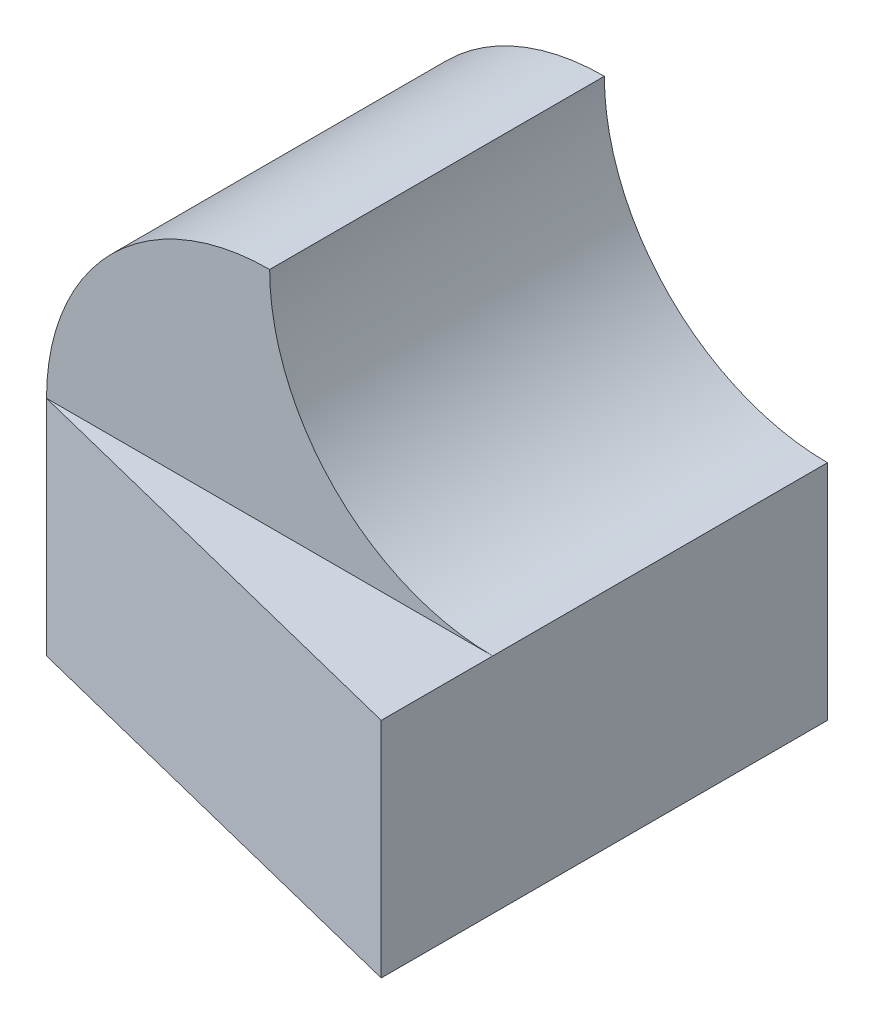
ISO-10303-21;
HEADER;
FILE_DESCRIPTION(('STEP AP214'),'2;1');
FILE_NAME('part.step','',(''),(''),'','','');
FILE_SCHEMA(('AUTOMOTIVE_DESIGN { 1 0 10303 214 1 1 1 1 }'));
ENDSEC;
DATA;
#1=APPLICATION_CONTEXT('core data for automotive mechanical design processes');
#2=APPLICATION_PROTOCOL_DEFINITION('international standard','automotive_design',2000,#1);
#3=PRODUCT_CONTEXT('',#1,'mechanical');
#4=PRODUCT('Part','Part','',(#3));
#5=PRODUCT_RELATED_PRODUCT_CATEGORY('part','',(#4));
#6=PRODUCT_DEFINITION_FORMATION('','',#4);
#7=PRODUCT_DEFINITION_CONTEXT('part definition',#1,'design');
#8=PRODUCT_DEFINITION('design','',#6,#7);
#9=PRODUCT_DEFINITION_SHAPE('','',#8);
#10=(LENGTH_UNIT() NAMED_UNIT(*) SI_UNIT(.MILLI.,.METRE.));
#11=(NAMED_UNIT(*) PLANE_ANGLE_UNIT() SI_UNIT($,.RADIAN.));
#12=(NAMED_UNIT(*) SI_UNIT($,.STERADIAN.) SOLID_ANGLE_UNIT());
#13=UNCERTAINTY_MEASURE_WITH_UNIT(LENGTH_MEASURE(1.E-05),#10,'distance_accuracy_value','');
#14=(GEOMETRIC_REPRESENTATION_CONTEXT(3) GLOBAL_UNCERTAINTY_ASSIGNED_CONTEXT((#13)) GLOBAL_UNIT_ASSIGNED_CONTEXT((#10,
#11,#12)) REPRESENTATION_CONTEXT('',''));
#15=CARTESIAN_POINT('',(0.,0.,0.));
#16=DIRECTION('',(0.,0.,1.));
#17=DIRECTION('',(1.,0.,0.));
#18=AXIS2_PLACEMENT_3D('',#15,#16,#17);
#19=CARTESIAN_POINT('',(0.,2.,3.));
#20=DIRECTION('',(1.,0.,0.));
#21=DIRECTION('',(0.,1.,0.));
#22=AXIS2_PLACEMENT_3D('',#19,#20,#21);
#23=PLANE('',#22);
#24=DIRECTION('',(0.,1.,0.));
#25=VECTOR('',#24,1.);
#26=CARTESIAN_POINT('',(0.,2.,1.));
#27=LINE('',#26,#25);
#28=CARTESIAN_POINT('',(0.,0.,1.));
#29=VERTEX_POINT('',#28);
#30=CARTESIAN_POINT('',(0.,2.,1.));
#31=VERTEX_POINT('',#30);
#32=EDGE_CURVE('E143',#29,#31,#27,.T.);
#33=ORIENTED_EDGE('',*,*,#32,.F.);
#34=DIRECTION('',(0.,0.,-1.));
#35=VECTOR('',#34,1.);
#36=CARTESIAN_POINT('',(0.,0.,3.));
#37=LINE('',#36,#35);
#38=CARTESIAN_POINT('',(0.,0.,3.));
#39=VERTEX_POINT('',#38);
#40=EDGE_CURVE('E11',#39,#29,#37,.T.);
#41=ORIENTED_EDGE('',*,*,#40,.F.);
#42=DIRECTION('',(0.,-1.,0.));
#43=VECTOR('',#42,1.);
#44=CARTESIAN_POINT('',(0.,2.,3.));
#45=LINE('',#44,#43);
#46=CARTESIAN_POINT('',(0.,2.,3.));
#47=VERTEX_POINT('',#46);
#48=EDGE_CURVE('E101',#47,#39,#45,.T.);
#49=ORIENTED_EDGE('',*,*,#48,.F.);
#50=DIRECTION('',(0.,0.,-1.));
#51=VECTOR('',#50,1.);
#52=CARTESIAN_POINT('',(0.,2.,3.));
#53=LINE('',#52,#51);
#54=EDGE_CURVE('E109',#47,#31,#53,.T.);
#55=ORIENTED_EDGE('',*,*,#54,.T.);
#56=EDGE_LOOP('',(#33,#41,#49,#55));
#57=FACE_BOUND('',#56,.T.);
#58=ADVANCED_FACE('F33',(#57),#23,.F.);
#59=CARTESIAN_POINT('',(0.,0.,3.));
#60=DIRECTION('',(0.,1.,0.));
#61=DIRECTION('',(0.,0.,1.));
#62=AXIS2_PLACEMENT_3D('',#59,#60,#61);
#63=PLANE('',#62);
#64=DIRECTION('',(-1.,0.,0.));
#65=VECTOR('',#64,1.);
#66=CARTESIAN_POINT('',(0.,0.,1.));
#67=LINE('',#66,#65);
#68=CARTESIAN_POINT('',(2.,0.,1.));
#69=VERTEX_POINT('',#68);
#70=EDGE_CURVE('E96',#69,#29,#67,.T.);
#71=ORIENTED_EDGE('',*,*,#70,.F.);
#72=DIRECTION('',(0.,0.,-1.));
#73=VECTOR('',#72,1.);
#74=CARTESIAN_POINT('',(2.,0.,1.));
#75=LINE('',#74,#73);
#76=CARTESIAN_POINT('',(2.,0.,0.));
#77=VERTEX_POINT('',#76);
#78=EDGE_CURVE('E87',#69,#77,#75,.T.);
#79=ORIENTED_EDGE('',*,*,#78,.T.);
#80=DIRECTION('',(1.,0.,0.));
#81=VECTOR('',#80,1.);
#82=CARTESIAN_POINT('',(0.,0.,0.));
#83=LINE('',#82,#81);
#84=CARTESIAN_POINT('',(4.,0.,0.));
#85=VERTEX_POINT('',#84);
#86=EDGE_CURVE('E95',#77,#85,#83,.T.);
#87=ORIENTED_EDGE('',*,*,#86,.T.);
#88=DIRECTION('',(0.,0.,-1.));
#89=VECTOR('',#88,1.);
#90=CARTESIAN_POINT('',(4.,0.,3.));
#91=LINE('',#90,#89);
#92=CARTESIAN_POINT('',(4.,0.,4.));
#93=VERTEX_POINT('',#92);
#94=EDGE_CURVE('E41',#93,#85,#91,.T.);
#95=ORIENTED_EDGE('',*,*,#94,.F.);
#96=DIRECTION('',(-0.970142500145332,0.,-0.242535625036333));
#97=VECTOR('',#96,1.);
#98=CARTESIAN_POINT('',(0.,0.,3.));
#99=LINE('',#98,#97);
#100=EDGE_CURVE('E133',#93,#39,#99,.T.);
#101=ORIENTED_EDGE('',*,*,#100,.T.);
#102=ORIENTED_EDGE('',*,*,#40,.T.);
#103=EDGE_LOOP('',(#71,#79,#87,#95,#101,#102));
#104=FACE_BOUND('',#103,.T.);
#105=ADVANCED_FACE('F158',(#104),#63,.F.);
#106=CARTESIAN_POINT('',(4.,0.,3.));
#107=DIRECTION('',(-1.,0.,0.));
#108=DIRECTION('',(0.,0.,1.));
#109=AXIS2_PLACEMENT_3D('',#106,#107,#108);
#110=PLANE('',#109);
#111=DIRECTION('',(0.,1.,0.));
#112=VECTOR('',#111,1.);
#113=CARTESIAN_POINT('',(4.,0.,0.));
#114=LINE('',#113,#112);
#115=CARTESIAN_POINT('',(4.,2.,0.));
#116=VERTEX_POINT('',#115);
#117=EDGE_CURVE('E105',#85,#116,#114,.T.);
#118=ORIENTED_EDGE('',*,*,#117,.T.);
#119=DIRECTION('',(0.,0.,-1.));
#120=VECTOR('',#119,1.);
#121=CARTESIAN_POINT('',(4.,2.,3.));
#122=LINE('',#121,#120);
#123=CARTESIAN_POINT('',(4.,2.,3.));
#124=VERTEX_POINT('',#123);
#125=EDGE_CURVE('E113',#124,#116,#122,.T.);
#126=ORIENTED_EDGE('',*,*,#125,.F.);
#127=DIRECTION('',(0.,0.,1.));
#128=VECTOR('',#127,1.);
#129=CARTESIAN_POINT('',(4.,2.,4.));
#130=LINE('',#129,#128);
#131=CARTESIAN_POINT('',(4.,2.,4.));
#132=VERTEX_POINT('',#131);
#133=EDGE_CURVE('E138',#124,#132,#130,.T.);
#134=ORIENTED_EDGE('',*,*,#133,.T.);
#135=DIRECTION('',(0.,-1.,0.));
#136=VECTOR('',#135,1.);
#137=CARTESIAN_POINT('',(4.,2.,4.));
#138=LINE('',#137,#136);
#139=EDGE_CURVE('E123',#132,#93,#138,.T.);
#140=ORIENTED_EDGE('',*,*,#139,.T.);
#141=ORIENTED_EDGE('',*,*,#94,.T.);
#142=EDGE_LOOP('',(#118,#126,#134,#140,#141));
#143=FACE_BOUND('',#142,.T.);
#144=ADVANCED_FACE('F118',(#143),#110,.F.);
#145=CARTESIAN_POINT('',(4.,4.,3.));
#146=DIRECTION('',(0.,0.,-1.));
#147=DIRECTION('',(-1.,0.,0.));
#148=AXIS2_PLACEMENT_3D('',#145,#146,#147);
#149=CYLINDRICAL_SURFACE('',#148,2.);
#150=CARTESIAN_POINT('',(4.,4.,0.));
#151=DIRECTION('',(0.,0.,-1.));
#152=DIRECTION('',(-1.,0.,0.));
#153=AXIS2_PLACEMENT_3D('',#150,#151,#152);
#154=CIRCLE('',#153,2.);
#155=CARTESIAN_POINT('',(2.,4.,0.));
#156=VERTEX_POINT('',#155);
#157=EDGE_CURVE('E66',#116,#156,#154,.T.);
#158=ORIENTED_EDGE('',*,*,#157,.T.);
#159=DIRECTION('',(0.,0.,-1.));
#160=VECTOR('',#159,1.);
#161=CARTESIAN_POINT('',(2.,4.,3.));
#162=LINE('',#161,#160);
#163=CARTESIAN_POINT('',(2.,4.,3.));
#164=VERTEX_POINT('',#163);
#165=EDGE_CURVE('E100',#164,#156,#162,.T.);
#166=ORIENTED_EDGE('',*,*,#165,.F.);
#167=CARTESIAN_POINT('',(4.,4.,3.));
#168=DIRECTION('',(0.,0.,-1.));
#169=DIRECTION('',(-1.,0.,0.));
#170=AXIS2_PLACEMENT_3D('',#167,#168,#169);
#171=CIRCLE('',#170,2.);
#172=EDGE_CURVE('E49',#124,#164,#171,.T.);
#173=ORIENTED_EDGE('',*,*,#172,.F.);
#174=ORIENTED_EDGE('',*,*,#125,.T.);
#175=EDGE_LOOP('',(#158,#166,#173,#174));
#176=FACE_BOUND('',#175,.T.);
#177=ADVANCED_FACE('F180',(#176),#149,.F.);
#178=CARTESIAN_POINT('',(2.,2.,3.));
#179=DIRECTION('',(0.,0.,-1.));
#180=DIRECTION('',(-1.,0.,0.));
#181=AXIS2_PLACEMENT_3D('',#178,#179,#180);
#182=CYLINDRICAL_SURFACE('',#181,2.);
#183=CARTESIAN_POINT('',(2.,2.,0.));
#184=DIRECTION('',(0.,0.,1.));
#185=DIRECTION('',(1.,0.,0.));
#186=AXIS2_PLACEMENT_3D('',#183,#184,#185);
#187=CIRCLE('',#186,2.);
#188=CARTESIAN_POINT('',(0.,2.,0.));
#189=VERTEX_POINT('',#188);
#190=EDGE_CURVE('E93',#156,#189,#187,.T.);
#191=ORIENTED_EDGE('',*,*,#190,.T.);
#192=DIRECTION('',(0.,0.,-1.));
#193=VECTOR('',#192,1.);
#194=CARTESIAN_POINT('',(0.,2.,1.));
#195=LINE('',#194,#193);
#196=EDGE_CURVE('E73',#31,#189,#195,.T.);
#197=ORIENTED_EDGE('',*,*,#196,.F.);
#198=ORIENTED_EDGE('',*,*,#54,.F.);
#199=CARTESIAN_POINT('',(2.,2.,3.));
#200=DIRECTION('',(0.,0.,1.));
#201=DIRECTION('',(1.,0.,0.));
#202=AXIS2_PLACEMENT_3D('',#199,#200,#201);
#203=CIRCLE('',#202,2.);
#204=EDGE_CURVE('E111',#164,#47,#203,.T.);
#205=ORIENTED_EDGE('',*,*,#204,.F.);
#206=ORIENTED_EDGE('',*,*,#165,.T.);
#207=EDGE_LOOP('',(#191,#197,#198,#205,#206));
#208=FACE_BOUND('',#207,.T.);
#209=ADVANCED_FACE('F98',(#208),#182,.T.);
#210=CARTESIAN_POINT('',(4.,4.,3.));
#211=DIRECTION('',(0.,0.,-1.));
#212=DIRECTION('',(-1.,0.,0.));
#213=AXIS2_PLACEMENT_3D('',#210,#211,#212);
#214=PLANE('',#213);
#215=ORIENTED_EDGE('',*,*,#204,.T.);
#216=DIRECTION('',(1.,0.,0.));
#217=VECTOR('',#216,1.);
#218=CARTESIAN_POINT('',(4.,2.,3.));
#219=LINE('',#218,#217);
#220=EDGE_CURVE('E135',#47,#124,#219,.T.);
#221=ORIENTED_EDGE('',*,*,#220,.T.);
#222=ORIENTED_EDGE('',*,*,#172,.T.);
#223=EDGE_LOOP('',(#215,#221,#222));
#224=FACE_BOUND('',#223,.T.);
#225=ADVANCED_FACE('F172',(#224),#214,.F.);
#226=CARTESIAN_POINT('',(4.,4.,0.));
#227=DIRECTION('',(0.,0.,-1.));
#228=DIRECTION('',(-1.,0.,0.));
#229=AXIS2_PLACEMENT_3D('',#226,#227,#228);
#230=PLANE('',#229);
#231=DIRECTION('',(0.707106781186547,-0.707106781186548,0.));
#232=VECTOR('',#231,1.);
#233=CARTESIAN_POINT('',(2.,0.,0.));
#234=LINE('',#233,#232);
#235=EDGE_CURVE('E78',#189,#77,#234,.T.);
#236=ORIENTED_EDGE('',*,*,#235,.F.);
#237=ORIENTED_EDGE('',*,*,#190,.F.);
#238=ORIENTED_EDGE('',*,*,#157,.F.);
#239=ORIENTED_EDGE('',*,*,#117,.F.);
#240=ORIENTED_EDGE('',*,*,#86,.F.);
#241=EDGE_LOOP('',(#236,#237,#238,#239,#240));
#242=FACE_BOUND('',#241,.T.);
#243=ADVANCED_FACE('F92',(#242),#230,.T.);
#244=CARTESIAN_POINT('',(0.,2.,3.));
#245=DIRECTION('',(-0.242535625036333,0.,0.970142500145332));
#246=DIRECTION('',(0.970142500145332,0.,0.242535625036333));
#247=AXIS2_PLACEMENT_3D('',#244,#245,#246);
#248=PLANE('',#247);
#249=ORIENTED_EDGE('',*,*,#100,.F.);
#250=ORIENTED_EDGE('',*,*,#139,.F.);
#251=DIRECTION('',(-0.970142500145332,0.,-0.242535625036333));
#252=VECTOR('',#251,1.);
#253=CARTESIAN_POINT('',(0.,2.,3.));
#254=LINE('',#253,#252);
#255=EDGE_CURVE('E132',#132,#47,#254,.T.);
#256=ORIENTED_EDGE('',*,*,#255,.T.);
#257=ORIENTED_EDGE('',*,*,#48,.T.);
#258=EDGE_LOOP('',(#249,#250,#256,#257));
#259=FACE_BOUND('',#258,.T.);
#260=ADVANCED_FACE('F161',(#259),#248,.T.);
#261=CARTESIAN_POINT('',(0.,2.,0.));
#262=DIRECTION('',(0.,-1.,0.));
#263=DIRECTION('',(0.,0.,-1.));
#264=AXIS2_PLACEMENT_3D('',#261,#262,#263);
#265=PLANE('',#264);
#266=ORIENTED_EDGE('',*,*,#220,.F.);
#267=ORIENTED_EDGE('',*,*,#255,.F.);
#268=ORIENTED_EDGE('',*,*,#133,.F.);
#269=EDGE_LOOP('',(#266,#267,#268));
#270=FACE_BOUND('',#269,.T.);
#271=ADVANCED_FACE('F171',(#270),#265,.F.);
#272=CARTESIAN_POINT('',(2.,0.,1.));
#273=DIRECTION('',(0.707106781186548,0.707106781186547,0.));
#274=DIRECTION('',(-0.707106781186547,0.707106781186548,0.));
#275=AXIS2_PLACEMENT_3D('',#272,#273,#274);
#276=PLANE('',#275);
#277=ORIENTED_EDGE('',*,*,#235,.T.);
#278=ORIENTED_EDGE('',*,*,#78,.F.);
#279=DIRECTION('',(0.707106781186547,-0.707106781186548,0.));
#280=VECTOR('',#279,1.);
#281=CARTESIAN_POINT('',(2.,0.,1.));
#282=LINE('',#281,#280);
#283=EDGE_CURVE('E82',#31,#69,#282,.T.);
#284=ORIENTED_EDGE('',*,*,#283,.F.);
#285=ORIENTED_EDGE('',*,*,#196,.T.);
#286=EDGE_LOOP('',(#277,#278,#284,#285));
#287=FACE_BOUND('',#286,.T.);
#288=ADVANCED_FACE('F75',(#287),#276,.F.);
#289=CARTESIAN_POINT('',(0.,0.,1.));
#290=DIRECTION('',(0.,0.,-1.));
#291=DIRECTION('',(-1.,0.,0.));
#292=AXIS2_PLACEMENT_3D('',#289,#290,#291);
#293=PLANE('',#292);
#294=ORIENTED_EDGE('',*,*,#70,.T.);
#295=ORIENTED_EDGE('',*,*,#32,.T.);
#296=ORIENTED_EDGE('',*,*,#283,.T.);
#297=EDGE_LOOP('',(#294,#295,#296));
#298=FACE_BOUND('',#297,.T.);
#299=ADVANCED_FACE('F151',(#298),#293,.T.);
#300=CLOSED_SHELL('',(#58,#105,#144,#177,#209,#225,#243,#260,#271,#288,#299));
#301=MANIFOLD_SOLID_BREP('B2',#300);
#302=ADVANCED_BREP_SHAPE_REPRESENTATION('',(#18,#301),#14);
#303=SHAPE_DEFINITION_REPRESENTATION(#9,#302);
ENDSEC;
END-ISO-10303-21;
